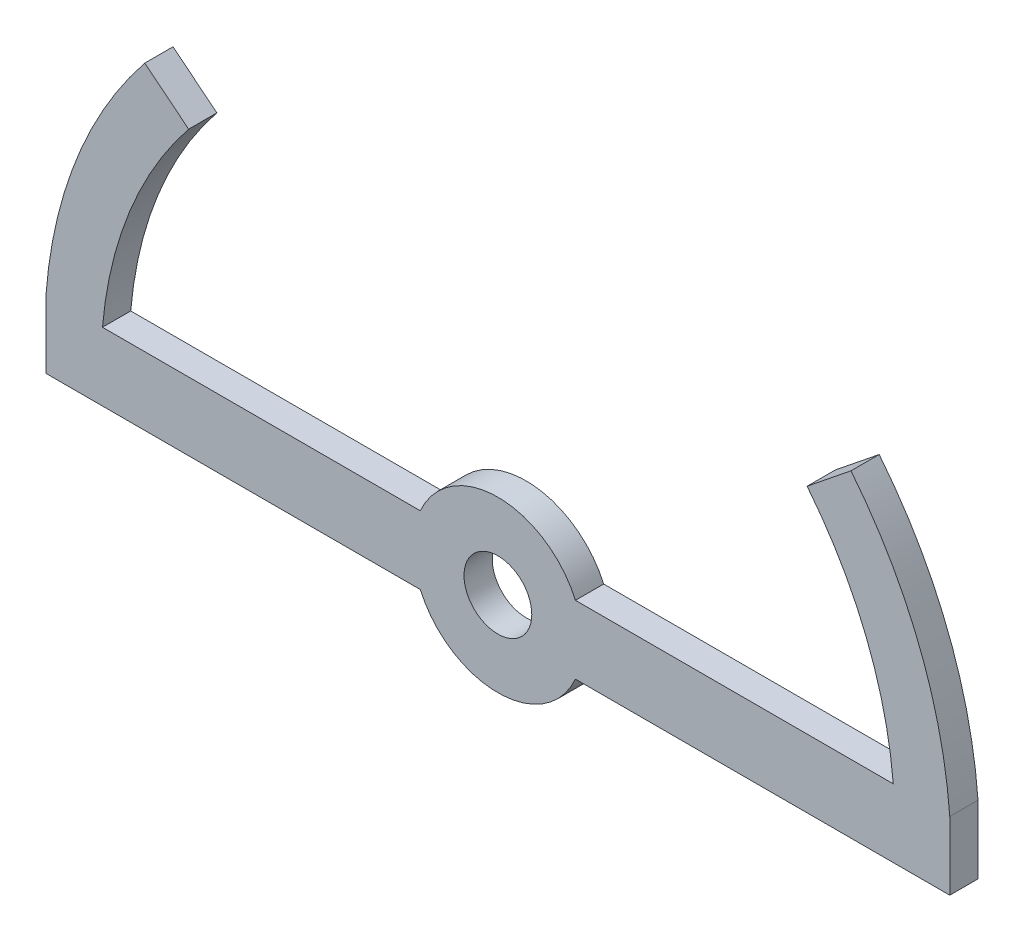
ISO-10303-21;
HEADER;
FILE_DESCRIPTION(('STEP AP214'),'2;1');
FILE_NAME('part.step','',(''),(''),'','','');
FILE_SCHEMA(('AUTOMOTIVE_DESIGN { 1 0 10303 214 1 1 1 1 }'));
ENDSEC;
DATA;
#1=APPLICATION_CONTEXT('core data for automotive mechanical design processes');
#2=APPLICATION_PROTOCOL_DEFINITION('international standard','automotive_design',2000,#1);
#3=PRODUCT_CONTEXT('',#1,'mechanical');
#4=PRODUCT('Part','Part','',(#3));
#5=PRODUCT_RELATED_PRODUCT_CATEGORY('part','',(#4));
#6=PRODUCT_DEFINITION_FORMATION('','',#4);
#7=PRODUCT_DEFINITION_CONTEXT('part definition',#1,'design');
#8=PRODUCT_DEFINITION('design','',#6,#7);
#9=PRODUCT_DEFINITION_SHAPE('','',#8);
#10=(LENGTH_UNIT() NAMED_UNIT(*) SI_UNIT(.MILLI.,.METRE.));
#11=(NAMED_UNIT(*) PLANE_ANGLE_UNIT() SI_UNIT($,.RADIAN.));
#12=(NAMED_UNIT(*) SI_UNIT($,.STERADIAN.) SOLID_ANGLE_UNIT());
#13=UNCERTAINTY_MEASURE_WITH_UNIT(LENGTH_MEASURE(1.E-05),#10,'distance_accuracy_value','');
#14=(GEOMETRIC_REPRESENTATION_CONTEXT(3) GLOBAL_UNCERTAINTY_ASSIGNED_CONTEXT((#13)) GLOBAL_UNIT_ASSIGNED_CONTEXT((#10,
#11,#12)) REPRESENTATION_CONTEXT('',''));
#15=CARTESIAN_POINT('',(0.,0.,0.));
#16=DIRECTION('',(0.,0.,1.));
#17=DIRECTION('',(1.,0.,0.));
#18=AXIS2_PLACEMENT_3D('',#15,#16,#17);
#19=CARTESIAN_POINT('',(0.,0.,-24.2132034355964));
#20=DIRECTION('',(0.,0.,1.));
#21=DIRECTION('',(1.,0.,0.));
#22=AXIS2_PLACEMENT_3D('',#19,#20,#21);
#23=CYLINDRICAL_SURFACE('',#22,7.5);
#24=DIRECTION('',(0.,0.,1.));
#25=VECTOR('',#24,1.);
#26=CARTESIAN_POINT('',(6.86513532213109,-3.01992003351547,-24.2132034355964));
#27=LINE('',#26,#25);
#28=CARTESIAN_POINT('',(6.86513532213109,-3.01992003351547,0.));
#29=VERTEX_POINT('',#28);
#30=CARTESIAN_POINT('',(6.86513532213109,-3.01992003351547,-2.49999999999998));
#31=VERTEX_POINT('',#30);
#32=EDGE_CURVE('E235',#29,#31,#27,.F.);
#33=ORIENTED_EDGE('',*,*,#32,.F.);
#34=CARTESIAN_POINT('',(0.,0.,0.));
#35=DIRECTION('',(0.,0.,1.));
#36=DIRECTION('',(1.,0.,0.));
#37=AXIS2_PLACEMENT_3D('',#34,#35,#36);
#38=CIRCLE('',#37,7.5);
#39=CARTESIAN_POINT('',(-6.86513532213109,-3.01992003351547,0.));
#40=VERTEX_POINT('',#39);
#41=EDGE_CURVE('E242',#40,#29,#38,.T.);
#42=ORIENTED_EDGE('',*,*,#41,.F.);
#43=DIRECTION('',(0.,0.,1.));
#44=VECTOR('',#43,1.);
#45=CARTESIAN_POINT('',(-6.86513532213109,-3.01992003351547,-24.2132034355964));
#46=LINE('',#45,#44);
#47=CARTESIAN_POINT('',(-6.86513532213109,-3.01992003351547,-2.49999999999998));
#48=VERTEX_POINT('',#47);
#49=EDGE_CURVE('E232',#48,#40,#46,.T.);
#50=ORIENTED_EDGE('',*,*,#49,.F.);
#51=CARTESIAN_POINT('',(0.,0.,-2.49999999999999));
#52=DIRECTION('',(0.,0.,1.));
#53=DIRECTION('',(1.,0.,0.));
#54=AXIS2_PLACEMENT_3D('',#51,#52,#53);
#55=CIRCLE('',#54,7.5);
#56=EDGE_CURVE('E42',#31,#48,#55,.F.);
#57=ORIENTED_EDGE('',*,*,#56,.F.);
#58=EDGE_LOOP('',(#33,#42,#50,#57));
#59=FACE_BOUND('',#58,.T.);
#60=ADVANCED_FACE('F34',(#59),#23,.T.);
#61=DIRECTION('',(0.,0.,1.));
#62=VECTOR('',#61,1.);
#63=CARTESIAN_POINT('',(-6.86513532213109,3.01992003351546,-24.2132034355964));
#64=LINE('',#63,#62);
#65=CARTESIAN_POINT('',(-6.86513532213109,3.01992003351546,0.));
#66=VERTEX_POINT('',#65);
#67=CARTESIAN_POINT('',(-6.86513532213109,3.01992003351546,-2.49999999999998));
#68=VERTEX_POINT('',#67);
#69=EDGE_CURVE('E229',#66,#68,#64,.F.);
#70=ORIENTED_EDGE('',*,*,#69,.F.);
#71=CARTESIAN_POINT('',(6.86513532213109,3.01992003351546,0.));
#72=VERTEX_POINT('',#71);
#73=EDGE_CURVE('E243',#72,#66,#38,.T.);
#74=ORIENTED_EDGE('',*,*,#73,.F.);
#75=DIRECTION('',(0.,0.,1.));
#76=VECTOR('',#75,1.);
#77=CARTESIAN_POINT('',(6.86513532213109,3.01992003351546,-24.2132034355964));
#78=LINE('',#77,#76);
#79=CARTESIAN_POINT('',(6.86513532213109,3.01992003351546,-2.49999999999998));
#80=VERTEX_POINT('',#79);
#81=EDGE_CURVE('E199',#80,#72,#78,.T.);
#82=ORIENTED_EDGE('',*,*,#81,.F.);
#83=EDGE_CURVE('E240',#68,#80,#55,.F.);
#84=ORIENTED_EDGE('',*,*,#83,.F.);
#85=EDGE_LOOP('',(#70,#74,#82,#84));
#86=FACE_BOUND('',#85,.T.);
#87=ADVANCED_FACE('F36',(#86),#23,.T.);
#88=CARTESIAN_POINT('',(0.,0.,0.));
#89=DIRECTION('',(0.,0.,1.));
#90=DIRECTION('',(1.,0.,0.));
#91=AXIS2_PLACEMENT_3D('',#88,#89,#90);
#92=PLANE('',#91);
#93=ORIENTED_EDGE('',*,*,#73,.T.);
#94=DIRECTION('',(1.,0.,0.));
#95=VECTOR('',#94,1.);
#96=CARTESIAN_POINT('',(40.,3.01992003351545,0.));
#97=LINE('',#96,#95);
#98=CARTESIAN_POINT('',(-35.,3.01992003351546,0.));
#99=VERTEX_POINT('',#98);
#100=EDGE_CURVE('E209',#99,#66,#97,.T.);
#101=ORIENTED_EDGE('',*,*,#100,.F.);
#102=CARTESIAN_POINT('',(0.,0.,0.));
#103=DIRECTION('',(0.,0.,1.));
#104=DIRECTION('',(1.,0.,0.));
#105=AXIS2_PLACEMENT_3D('',#102,#103,#104);
#106=CIRCLE('',#105,35.1300429406061);
#107=CARTESIAN_POINT('',(-27.3723042275657,22.0199200335155,0.));
#108=VERTEX_POINT('',#107);
#109=EDGE_CURVE('E190',#108,#99,#106,.T.);
#110=ORIENTED_EDGE('',*,*,#109,.F.);
#111=DIRECTION('',(0.779170816097313,-0.62681164582532,0.));
#112=VECTOR('',#111,1.);
#113=CARTESIAN_POINT('',(-27.3723042275657,22.0199200335155,0.));
#114=LINE('',#113,#112);
#115=CARTESIAN_POINT('',(-31.2555310940811,25.1438201758555,0.));
#116=VERTEX_POINT('',#115);
#117=EDGE_CURVE('E176',#116,#108,#114,.T.);
#118=ORIENTED_EDGE('',*,*,#117,.F.);
#119=CARTESIAN_POINT('',(0.,0.,0.));
#120=DIRECTION('',(0.,0.,1.));
#121=DIRECTION('',(1.,0.,0.));
#122=AXIS2_PLACEMENT_3D('',#119,#120,#121);
#123=CIRCLE('',#122,40.113836976894);
#124=CARTESIAN_POINT('',(-40.,3.01992003351546,0.));
#125=VERTEX_POINT('',#124);
#126=EDGE_CURVE('E185',#125,#116,#123,.F.);
#127=ORIENTED_EDGE('',*,*,#126,.F.);
#128=DIRECTION('',(0.,1.,0.));
#129=VECTOR('',#128,1.);
#130=CARTESIAN_POINT('',(-40.,-3.01992003351546,0.));
#131=LINE('',#130,#129);
#132=CARTESIAN_POINT('',(-40.,-3.01992003351546,0.));
#133=VERTEX_POINT('',#132);
#134=EDGE_CURVE('E195',#133,#125,#131,.T.);
#135=ORIENTED_EDGE('',*,*,#134,.F.);
#136=DIRECTION('',(-1.,0.,0.));
#137=VECTOR('',#136,1.);
#138=CARTESIAN_POINT('',(40.,-3.01992003351547,0.));
#139=LINE('',#138,#137);
#140=EDGE_CURVE('E217',#40,#133,#139,.T.);
#141=ORIENTED_EDGE('',*,*,#140,.F.);
#142=ORIENTED_EDGE('',*,*,#41,.T.);
#143=CARTESIAN_POINT('',(40.,-3.01992003351547,0.));
#144=VERTEX_POINT('',#143);
#145=EDGE_CURVE('E214',#144,#29,#139,.T.);
#146=ORIENTED_EDGE('',*,*,#145,.F.);
#147=DIRECTION('',(0.,-1.,0.));
#148=VECTOR('',#147,1.);
#149=CARTESIAN_POINT('',(40.,-3.01992003351547,0.));
#150=LINE('',#149,#148);
#151=CARTESIAN_POINT('',(40.,3.01992003351545,0.));
#152=VERTEX_POINT('',#151);
#153=EDGE_CURVE('E218',#152,#144,#150,.T.);
#154=ORIENTED_EDGE('',*,*,#153,.F.);
#155=CARTESIAN_POINT('',(0.,0.,0.));
#156=DIRECTION('',(0.,0.,1.));
#157=DIRECTION('',(1.,0.,0.));
#158=AXIS2_PLACEMENT_3D('',#155,#156,#157);
#159=CIRCLE('',#158,40.113836976894);
#160=CARTESIAN_POINT('',(31.2555310940811,25.1438201758555,0.));
#161=VERTEX_POINT('',#160);
#162=EDGE_CURVE('E144',#161,#152,#159,.F.);
#163=ORIENTED_EDGE('',*,*,#162,.F.);
#164=DIRECTION('',(0.779170816097313,0.62681164582532,0.));
#165=VECTOR('',#164,1.);
#166=CARTESIAN_POINT('',(27.3723042275657,22.0199200335155,0.));
#167=LINE('',#166,#165);
#168=CARTESIAN_POINT('',(27.3723042275657,22.0199200335155,0.));
#169=VERTEX_POINT('',#168);
#170=EDGE_CURVE('E141',#169,#161,#167,.T.);
#171=ORIENTED_EDGE('',*,*,#170,.F.);
#172=CARTESIAN_POINT('',(0.,0.,0.));
#173=DIRECTION('',(0.,0.,1.));
#174=DIRECTION('',(1.,0.,0.));
#175=AXIS2_PLACEMENT_3D('',#172,#173,#174);
#176=CIRCLE('',#175,35.1300429406061);
#177=CARTESIAN_POINT('',(35.,3.01992003351545,0.));
#178=VERTEX_POINT('',#177);
#179=EDGE_CURVE('E162',#178,#169,#176,.T.);
#180=ORIENTED_EDGE('',*,*,#179,.F.);
#181=EDGE_CURVE('E49',#72,#178,#97,.T.);
#182=ORIENTED_EDGE('',*,*,#181,.F.);
#183=EDGE_LOOP('',(#93,#101,#110,#118,#127,#135,#141,#142,#146,#154,#163,#171,#180,#182));
#184=FACE_BOUND('',#183,.T.);
#185=CARTESIAN_POINT('',(0.,0.,0.));
#186=DIRECTION('',(0.,0.,1.));
#187=DIRECTION('',(1.,0.,0.));
#188=AXIS2_PLACEMENT_3D('',#185,#186,#187);
#189=CIRCLE('',#188,3.);
#190=CARTESIAN_POINT('',(3.,0.,0.));
#191=VERTEX_POINT('',#190);
#192=EDGE_CURVE('E237',#191,#191,#189,.T.);
#193=ORIENTED_EDGE('',*,*,#192,.F.);
#194=EDGE_LOOP('',(#193));
#195=FACE_BOUND('',#194,.T.);
#196=ADVANCED_FACE('F250',(#184,#195),#92,.T.);
#197=CARTESIAN_POINT('',(0.,0.,-24.2132034355964));
#198=DIRECTION('',(0.,0.,1.));
#199=DIRECTION('',(1.,0.,0.));
#200=AXIS2_PLACEMENT_3D('',#197,#198,#199);
#201=CYLINDRICAL_SURFACE('',#200,3.);
#202=CARTESIAN_POINT('',(0.,0.,-2.49999999999999));
#203=DIRECTION('',(0.,0.,1.));
#204=DIRECTION('',(1.,0.,0.));
#205=AXIS2_PLACEMENT_3D('',#202,#203,#204);
#206=CIRCLE('',#205,3.);
#207=CARTESIAN_POINT('',(3.,0.,-2.49999999999999));
#208=VERTEX_POINT('',#207);
#209=EDGE_CURVE('E12',#208,#208,#206,.F.);
#210=ORIENTED_EDGE('',*,*,#209,.T.);
#211=EDGE_LOOP('',(#210));
#212=FACE_BOUND('',#211,.T.);
#213=ORIENTED_EDGE('',*,*,#192,.T.);
#214=EDGE_LOOP('',(#213));
#215=FACE_BOUND('',#214,.T.);
#216=ADVANCED_FACE('F284',(#212,#215),#201,.F.);
#217=CARTESIAN_POINT('',(0.,0.,-2.49999999999998));
#218=DIRECTION('',(0.,0.,1.));
#219=DIRECTION('',(0.997914380415625,0.0645514473865562,0.));
#220=AXIS2_PLACEMENT_3D('',#217,#218,#219);
#221=PLANE('',#220);
#222=ORIENTED_EDGE('',*,*,#83,.T.);
#223=DIRECTION('',(1.,0.,0.));
#224=VECTOR('',#223,1.);
#225=CARTESIAN_POINT('',(40.,3.01992003351545,-2.49999999999998));
#226=LINE('',#225,#224);
#227=CARTESIAN_POINT('',(35.,3.01992003351545,-2.49999999999998));
#228=VERTEX_POINT('',#227);
#229=EDGE_CURVE('E205',#80,#228,#226,.T.);
#230=ORIENTED_EDGE('',*,*,#229,.T.);
#231=CARTESIAN_POINT('',(0.,0.,-2.49999999999998));
#232=DIRECTION('',(0.,0.,1.));
#233=DIRECTION('',(1.,0.,0.));
#234=AXIS2_PLACEMENT_3D('',#231,#232,#233);
#235=CIRCLE('',#234,35.1300429406061);
#236=CARTESIAN_POINT('',(27.3723042275657,22.0199200335155,-2.49999999999998));
#237=VERTEX_POINT('',#236);
#238=EDGE_CURVE('E154',#228,#237,#235,.T.);
#239=ORIENTED_EDGE('',*,*,#238,.T.);
#240=DIRECTION('',(0.779170816097313,0.62681164582532,0.));
#241=VECTOR('',#240,1.);
#242=CARTESIAN_POINT('',(27.3723042275657,22.0199200335155,-2.49999999999998));
#243=LINE('',#242,#241);
#244=CARTESIAN_POINT('',(31.2555310940811,25.1438201758555,-2.49999999999998));
#245=VERTEX_POINT('',#244);
#246=EDGE_CURVE('E140',#237,#245,#243,.T.);
#247=ORIENTED_EDGE('',*,*,#246,.T.);
#248=CARTESIAN_POINT('',(0.,0.,-2.49999999999998));
#249=DIRECTION('',(0.,0.,-1.));
#250=DIRECTION('',(1.,0.,0.));
#251=AXIS2_PLACEMENT_3D('',#248,#249,#250);
#252=CIRCLE('',#251,40.113836976894);
#253=CARTESIAN_POINT('',(40.,3.01992003351546,-2.49999999999998));
#254=VERTEX_POINT('',#253);
#255=EDGE_CURVE('E148',#245,#254,#252,.T.);
#256=ORIENTED_EDGE('',*,*,#255,.T.);
#257=DIRECTION('',(0.,-1.,0.));
#258=VECTOR('',#257,1.);
#259=CARTESIAN_POINT('',(40.,-3.01992003351547,-2.49999999999998));
#260=LINE('',#259,#258);
#261=CARTESIAN_POINT('',(40.,-3.01992003351547,-2.49999999999998));
#262=VERTEX_POINT('',#261);
#263=EDGE_CURVE('E201',#254,#262,#260,.T.);
#264=ORIENTED_EDGE('',*,*,#263,.T.);
#265=DIRECTION('',(-1.,0.,0.));
#266=VECTOR('',#265,1.);
#267=CARTESIAN_POINT('',(40.,-3.01992003351547,-2.49999999999998));
#268=LINE('',#267,#266);
#269=EDGE_CURVE('E196',#262,#31,#268,.T.);
#270=ORIENTED_EDGE('',*,*,#269,.T.);
#271=ORIENTED_EDGE('',*,*,#56,.T.);
#272=CARTESIAN_POINT('',(-40.,-3.01992003351546,-2.49999999999998));
#273=VERTEX_POINT('',#272);
#274=EDGE_CURVE('E200',#48,#273,#268,.T.);
#275=ORIENTED_EDGE('',*,*,#274,.T.);
#276=DIRECTION('',(0.,1.,0.));
#277=VECTOR('',#276,1.);
#278=CARTESIAN_POINT('',(-40.,-3.01992003351546,-2.49999999999998));
#279=LINE('',#278,#277);
#280=CARTESIAN_POINT('',(-40.,3.01992003351546,-2.49999999999998));
#281=VERTEX_POINT('',#280);
#282=EDGE_CURVE('E206',#273,#281,#279,.T.);
#283=ORIENTED_EDGE('',*,*,#282,.T.);
#284=CARTESIAN_POINT('',(0.,0.,-2.49999999999998));
#285=DIRECTION('',(0.,0.,-1.));
#286=DIRECTION('',(-1.,0.,0.));
#287=AXIS2_PLACEMENT_3D('',#284,#285,#286);
#288=CIRCLE('',#287,40.113836976894);
#289=CARTESIAN_POINT('',(-31.2555310940811,25.1438201758555,-2.49999999999998));
#290=VERTEX_POINT('',#289);
#291=EDGE_CURVE('E167',#281,#290,#288,.T.);
#292=ORIENTED_EDGE('',*,*,#291,.T.);
#293=DIRECTION('',(0.779170816097313,-0.62681164582532,0.));
#294=VECTOR('',#293,1.);
#295=CARTESIAN_POINT('',(-27.3723042275657,22.0199200335155,-2.49999999999998));
#296=LINE('',#295,#294);
#297=CARTESIAN_POINT('',(-27.3723042275657,22.0199200335155,-2.49999999999998));
#298=VERTEX_POINT('',#297);
#299=EDGE_CURVE('E177',#290,#298,#296,.T.);
#300=ORIENTED_EDGE('',*,*,#299,.T.);
#301=CARTESIAN_POINT('',(0.,0.,-2.49999999999998));
#302=DIRECTION('',(0.,0.,1.));
#303=DIRECTION('',(-1.,0.,0.));
#304=AXIS2_PLACEMENT_3D('',#301,#302,#303);
#305=CIRCLE('',#304,35.1300429406061);
#306=CARTESIAN_POINT('',(-35.,3.01992003351546,-2.49999999999998));
#307=VERTEX_POINT('',#306);
#308=EDGE_CURVE('E173',#298,#307,#305,.T.);
#309=ORIENTED_EDGE('',*,*,#308,.T.);
#310=EDGE_CURVE('E203',#307,#68,#226,.T.);
#311=ORIENTED_EDGE('',*,*,#310,.T.);
#312=EDGE_LOOP('',(#222,#230,#239,#247,#256,#264,#270,#271,#275,#283,#292,#300,#309,#311));
#313=FACE_BOUND('',#312,.T.);
#314=ORIENTED_EDGE('',*,*,#209,.F.);
#315=EDGE_LOOP('',(#314));
#316=FACE_BOUND('',#315,.T.);
#317=ADVANCED_FACE('F158',(#313,#316),#221,.F.);
#318=CARTESIAN_POINT('',(40.,-3.01992003351547,80.227673953788));
#319=DIRECTION('',(1.,0.,0.));
#320=DIRECTION('',(0.,0.,-1.));
#321=AXIS2_PLACEMENT_3D('',#318,#319,#320);
#322=PLANE('',#321);
#323=DIRECTION('',(0.,0.,-1.));
#324=VECTOR('',#323,1.);
#325=CARTESIAN_POINT('',(40.,3.01992003351545,80.227673953788));
#326=LINE('',#325,#324);
#327=EDGE_CURVE('E151',#152,#254,#326,.T.);
#328=ORIENTED_EDGE('',*,*,#327,.F.);
#329=ORIENTED_EDGE('',*,*,#153,.T.);
#330=DIRECTION('',(0.,0.,-1.));
#331=VECTOR('',#330,1.);
#332=CARTESIAN_POINT('',(40.,-3.01992003351547,80.227673953788));
#333=LINE('',#332,#331);
#334=EDGE_CURVE('E221',#144,#262,#333,.T.);
#335=ORIENTED_EDGE('',*,*,#334,.T.);
#336=ORIENTED_EDGE('',*,*,#263,.F.);
#337=EDGE_LOOP('',(#328,#329,#335,#336));
#338=FACE_BOUND('',#337,.T.);
#339=ADVANCED_FACE('F262',(#338),#322,.T.);
#340=CARTESIAN_POINT('',(40.,3.01992003351545,80.227673953788));
#341=DIRECTION('',(0.,1.,0.));
#342=DIRECTION('',(-1.,0.,0.));
#343=AXIS2_PLACEMENT_3D('',#340,#341,#342);
#344=PLANE('',#343);
#345=DIRECTION('',(0.,0.,-1.));
#346=VECTOR('',#345,1.);
#347=CARTESIAN_POINT('',(35.,3.01992003351546,25.474019275124));
#348=LINE('',#347,#346);
#349=EDGE_CURVE('E54',#178,#228,#348,.T.);
#350=ORIENTED_EDGE('',*,*,#349,.T.);
#351=ORIENTED_EDGE('',*,*,#229,.F.);
#352=ORIENTED_EDGE('',*,*,#81,.T.);
#353=ORIENTED_EDGE('',*,*,#181,.T.);
#354=EDGE_LOOP('',(#350,#351,#352,#353));
#355=FACE_BOUND('',#354,.T.);
#356=ADVANCED_FACE('F306',(#355),#344,.T.);
#357=CARTESIAN_POINT('',(40.,-3.01992003351547,80.227673953788));
#358=DIRECTION('',(0.,-1.,0.));
#359=DIRECTION('',(1.,0.,0.));
#360=AXIS2_PLACEMENT_3D('',#357,#358,#359);
#361=PLANE('',#360);
#362=ORIENTED_EDGE('',*,*,#145,.T.);
#363=ORIENTED_EDGE('',*,*,#32,.T.);
#364=ORIENTED_EDGE('',*,*,#269,.F.);
#365=ORIENTED_EDGE('',*,*,#334,.F.);
#366=EDGE_LOOP('',(#362,#363,#364,#365));
#367=FACE_BOUND('',#366,.T.);
#368=ADVANCED_FACE('F260',(#367),#361,.T.);
#369=DIRECTION('',(0.,0.,-1.));
#370=VECTOR('',#369,1.);
#371=CARTESIAN_POINT('',(-35.,3.01992003351546,25.474019275124));
#372=LINE('',#371,#370);
#373=EDGE_CURVE('E189',#99,#307,#372,.T.);
#374=ORIENTED_EDGE('',*,*,#373,.F.);
#375=ORIENTED_EDGE('',*,*,#100,.T.);
#376=ORIENTED_EDGE('',*,*,#69,.T.);
#377=ORIENTED_EDGE('',*,*,#310,.F.);
#378=EDGE_LOOP('',(#374,#375,#376,#377));
#379=FACE_BOUND('',#378,.T.);
#380=ADVANCED_FACE('F291',(#379),#344,.T.);
#381=CARTESIAN_POINT('',(-40.,-3.01992003351546,80.227673953788));
#382=DIRECTION('',(-1.,0.,0.));
#383=DIRECTION('',(0.,0.,1.));
#384=AXIS2_PLACEMENT_3D('',#381,#382,#383);
#385=PLANE('',#384);
#386=DIRECTION('',(0.,0.,-1.));
#387=VECTOR('',#386,1.);
#388=CARTESIAN_POINT('',(-40.,-3.01992003351546,80.227673953788));
#389=LINE('',#388,#387);
#390=EDGE_CURVE('E216',#133,#273,#389,.T.);
#391=ORIENTED_EDGE('',*,*,#390,.F.);
#392=ORIENTED_EDGE('',*,*,#134,.T.);
#393=DIRECTION('',(0.,0.,-1.));
#394=VECTOR('',#393,1.);
#395=CARTESIAN_POINT('',(-40.,3.01992003351546,80.227673953788));
#396=LINE('',#395,#394);
#397=EDGE_CURVE('E213',#125,#281,#396,.T.);
#398=ORIENTED_EDGE('',*,*,#397,.T.);
#399=ORIENTED_EDGE('',*,*,#282,.F.);
#400=EDGE_LOOP('',(#391,#392,#398,#399));
#401=FACE_BOUND('',#400,.T.);
#402=ADVANCED_FACE('F303',(#401),#385,.T.);
#403=ORIENTED_EDGE('',*,*,#274,.F.);
#404=ORIENTED_EDGE('',*,*,#49,.T.);
#405=ORIENTED_EDGE('',*,*,#140,.T.);
#406=ORIENTED_EDGE('',*,*,#390,.T.);
#407=EDGE_LOOP('',(#403,#404,#405,#406));
#408=FACE_BOUND('',#407,.T.);
#409=ADVANCED_FACE('F305',(#408),#361,.T.);
#410=CARTESIAN_POINT('',(-27.3723042275657,22.0199200335155,25.474019275124));
#411=DIRECTION('',(0.62681164582532,0.779170816097313,0.));
#412=DIRECTION('',(-0.779170816097313,0.62681164582532,0.));
#413=AXIS2_PLACEMENT_3D('',#410,#411,#412);
#414=PLANE('',#413);
#415=DIRECTION('',(0.,0.,-1.));
#416=VECTOR('',#415,1.);
#417=CARTESIAN_POINT('',(-31.2555310940811,25.1438201758555,25.474019275124));
#418=LINE('',#417,#416);
#419=EDGE_CURVE('E188',#116,#290,#418,.T.);
#420=ORIENTED_EDGE('',*,*,#419,.F.);
#421=ORIENTED_EDGE('',*,*,#117,.T.);
#422=DIRECTION('',(0.,0.,-1.));
#423=VECTOR('',#422,1.);
#424=CARTESIAN_POINT('',(-27.3723042275657,22.0199200335155,25.474019275124));
#425=LINE('',#424,#423);
#426=EDGE_CURVE('E184',#108,#298,#425,.T.);
#427=ORIENTED_EDGE('',*,*,#426,.T.);
#428=ORIENTED_EDGE('',*,*,#299,.F.);
#429=EDGE_LOOP('',(#420,#421,#427,#428));
#430=FACE_BOUND('',#429,.T.);
#431=ADVANCED_FACE('F298',(#430),#414,.T.);
#432=CARTESIAN_POINT('',(0.,0.,25.474019275124));
#433=DIRECTION('',(0.,0.,-1.));
#434=DIRECTION('',(-1.,0.,0.));
#435=AXIS2_PLACEMENT_3D('',#432,#433,#434);
#436=CYLINDRICAL_SURFACE('',#435,35.1300429406061);
#437=ORIENTED_EDGE('',*,*,#426,.F.);
#438=ORIENTED_EDGE('',*,*,#109,.T.);
#439=ORIENTED_EDGE('',*,*,#373,.T.);
#440=ORIENTED_EDGE('',*,*,#308,.F.);
#441=EDGE_LOOP('',(#437,#438,#439,#440));
#442=FACE_BOUND('',#441,.T.);
#443=ADVANCED_FACE('F273',(#442),#436,.F.);
#444=CARTESIAN_POINT('',(0.,0.,25.474019275124));
#445=DIRECTION('',(0.,0.,-1.));
#446=DIRECTION('',(-1.,0.,0.));
#447=AXIS2_PLACEMENT_3D('',#444,#445,#446);
#448=CYLINDRICAL_SURFACE('',#447,40.113836976894);
#449=ORIENTED_EDGE('',*,*,#397,.F.);
#450=ORIENTED_EDGE('',*,*,#126,.T.);
#451=ORIENTED_EDGE('',*,*,#419,.T.);
#452=ORIENTED_EDGE('',*,*,#291,.F.);
#453=EDGE_LOOP('',(#449,#450,#451,#452));
#454=FACE_BOUND('',#453,.T.);
#455=ADVANCED_FACE('F266',(#454),#448,.T.);
#456=CARTESIAN_POINT('',(0.,0.,25.474019275124));
#457=DIRECTION('',(0.,0.,-1.));
#458=DIRECTION('',(-1.,0.,0.));
#459=AXIS2_PLACEMENT_3D('',#456,#457,#458);
#460=CYLINDRICAL_SURFACE('',#459,35.1300429406061);
#461=ORIENTED_EDGE('',*,*,#349,.F.);
#462=ORIENTED_EDGE('',*,*,#179,.T.);
#463=DIRECTION('',(0.,0.,-1.));
#464=VECTOR('',#463,1.);
#465=CARTESIAN_POINT('',(27.3723042275657,22.0199200335155,25.474019275124));
#466=LINE('',#465,#464);
#467=EDGE_CURVE('E169',#169,#237,#466,.T.);
#468=ORIENTED_EDGE('',*,*,#467,.T.);
#469=ORIENTED_EDGE('',*,*,#238,.F.);
#470=EDGE_LOOP('',(#461,#462,#468,#469));
#471=FACE_BOUND('',#470,.T.);
#472=ADVANCED_FACE('F264',(#471),#460,.F.);
#473=CARTESIAN_POINT('',(27.3723042275657,22.0199200335155,25.474019275124));
#474=DIRECTION('',(-0.62681164582532,0.779170816097313,0.));
#475=DIRECTION('',(-0.779170816097313,-0.62681164582532,0.));
#476=AXIS2_PLACEMENT_3D('',#473,#474,#475);
#477=PLANE('',#476);
#478=ORIENTED_EDGE('',*,*,#467,.F.);
#479=ORIENTED_EDGE('',*,*,#170,.T.);
#480=DIRECTION('',(0.,0.,-1.));
#481=VECTOR('',#480,1.);
#482=CARTESIAN_POINT('',(31.2555310940811,25.1438201758555,25.474019275124));
#483=LINE('',#482,#481);
#484=EDGE_CURVE('E135',#161,#245,#483,.T.);
#485=ORIENTED_EDGE('',*,*,#484,.T.);
#486=ORIENTED_EDGE('',*,*,#246,.F.);
#487=EDGE_LOOP('',(#478,#479,#485,#486));
#488=FACE_BOUND('',#487,.T.);
#489=ADVANCED_FACE('F138',(#488),#477,.T.);
#490=CARTESIAN_POINT('',(0.,0.,25.474019275124));
#491=DIRECTION('',(0.,0.,-1.));
#492=DIRECTION('',(-1.,0.,0.));
#493=AXIS2_PLACEMENT_3D('',#490,#491,#492);
#494=CYLINDRICAL_SURFACE('',#493,40.113836976894);
#495=ORIENTED_EDGE('',*,*,#484,.F.);
#496=ORIENTED_EDGE('',*,*,#162,.T.);
#497=ORIENTED_EDGE('',*,*,#327,.T.);
#498=ORIENTED_EDGE('',*,*,#255,.F.);
#499=EDGE_LOOP('',(#495,#496,#497,#498));
#500=FACE_BOUND('',#499,.T.);
#501=ADVANCED_FACE('F149',(#500),#494,.T.);
#502=CLOSED_SHELL('',(#60,#87,#196,#216,#317,#339,#356,#368,#380,#402,#409,#431,#443,#455,#472,
#489,#501));
#503=MANIFOLD_SOLID_BREP('B2',#502);
#504=ADVANCED_BREP_SHAPE_REPRESENTATION('',(#18,#503),#14);
#505=SHAPE_DEFINITION_REPRESENTATION(#9,#504);
ENDSEC;
END-ISO-10303-21;
